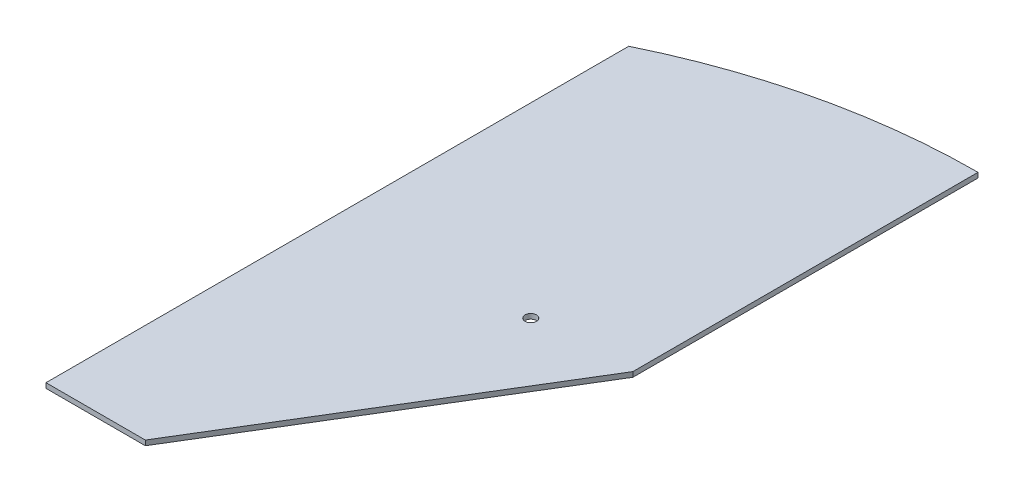
ISO-10303-21;
HEADER;
FILE_DESCRIPTION(('STEP AP214'),'2;1');
FILE_NAME('part.step','',(''),(''),'','','');
FILE_SCHEMA(('AUTOMOTIVE_DESIGN { 1 0 10303 214 1 1 1 1 }'));
ENDSEC;
DATA;
#1=APPLICATION_CONTEXT('core data for automotive mechanical design processes');
#2=APPLICATION_PROTOCOL_DEFINITION('international standard','automotive_design',2000,#1);
#3=PRODUCT_CONTEXT('',#1,'mechanical');
#4=PRODUCT('Part','Part','',(#3));
#5=PRODUCT_RELATED_PRODUCT_CATEGORY('part','',(#4));
#6=PRODUCT_DEFINITION_FORMATION('','',#4);
#7=PRODUCT_DEFINITION_CONTEXT('part definition',#1,'design');
#8=PRODUCT_DEFINITION('design','',#6,#7);
#9=PRODUCT_DEFINITION_SHAPE('','',#8);
#10=(LENGTH_UNIT() NAMED_UNIT(*) SI_UNIT(.MILLI.,.METRE.));
#11=(NAMED_UNIT(*) PLANE_ANGLE_UNIT() SI_UNIT($,.RADIAN.));
#12=(NAMED_UNIT(*) SI_UNIT($,.STERADIAN.) SOLID_ANGLE_UNIT());
#13=UNCERTAINTY_MEASURE_WITH_UNIT(LENGTH_MEASURE(1.E-05),#10,'distance_accuracy_value','');
#14=(GEOMETRIC_REPRESENTATION_CONTEXT(3) GLOBAL_UNCERTAINTY_ASSIGNED_CONTEXT((#13)) GLOBAL_UNIT_ASSIGNED_CONTEXT((#10,
#11,#12)) REPRESENTATION_CONTEXT('',''));
#15=CARTESIAN_POINT('',(0.,0.,0.));
#16=DIRECTION('',(0.,0.,1.));
#17=DIRECTION('',(1.,0.,0.));
#18=AXIS2_PLACEMENT_3D('',#15,#16,#17);
#19=CARTESIAN_POINT('',(-90.1768403474196,1.925,-167.326045177922));
#20=DIRECTION('',(1.,0.,0.));
#21=DIRECTION('',(0.,0.,-1.));
#22=AXIS2_PLACEMENT_3D('',#19,#20,#21);
#23=PLANE('',#22);
#24=DIRECTION('',(0.,0.,1.));
#25=VECTOR('',#24,1.);
#26=CARTESIAN_POINT('',(-90.1768403474196,-1.575,-167.326045177922));
#27=LINE('',#26,#25);
#28=CARTESIAN_POINT('',(-90.1768403474195,-1.575,-167.326045177923));
#29=VERTEX_POINT('',#28);
#30=CARTESIAN_POINT('',(-90.1768403474196,-1.575,243.331412765094));
#31=VERTEX_POINT('',#30);
#32=EDGE_CURVE('E117',#29,#31,#27,.T.);
#33=ORIENTED_EDGE('',*,*,#32,.T.);
#34=DIRECTION('',(0.,-1.,0.));
#35=VECTOR('',#34,1.);
#36=CARTESIAN_POINT('',(-90.1768403474196,1.925,243.331412765094));
#37=LINE('',#36,#35);
#38=CARTESIAN_POINT('',(-90.1768403474196,1.925,243.331412765094));
#39=VERTEX_POINT('',#38);
#40=EDGE_CURVE('E11',#39,#31,#37,.T.);
#41=ORIENTED_EDGE('',*,*,#40,.F.);
#42=DIRECTION('',(0.,0.,1.));
#43=VECTOR('',#42,1.);
#44=CARTESIAN_POINT('',(-90.1768403474196,1.925,-167.326045177922));
#45=LINE('',#44,#43);
#46=CARTESIAN_POINT('',(-90.1768403474195,1.925,-167.326045177923));
#47=VERTEX_POINT('',#46);
#48=EDGE_CURVE('E131',#47,#39,#45,.T.);
#49=ORIENTED_EDGE('',*,*,#48,.F.);
#50=DIRECTION('',(0.,-1.,0.));
#51=VECTOR('',#50,1.);
#52=CARTESIAN_POINT('',(-90.1768403474195,1.925,-167.326045177923));
#53=LINE('',#52,#51);
#54=EDGE_CURVE('E113',#47,#29,#53,.T.);
#55=ORIENTED_EDGE('',*,*,#54,.T.);
#56=EDGE_LOOP('',(#33,#41,#49,#55));
#57=FACE_BOUND('',#56,.T.);
#58=ADVANCED_FACE('F38',(#57),#23,.F.);
#59=CARTESIAN_POINT('',(-20.1768403474217,1.925,243.331412765094));
#60=DIRECTION('',(0.,0.,-1.));
#61=DIRECTION('',(-1.,0.,0.));
#62=AXIS2_PLACEMENT_3D('',#59,#60,#61);
#63=PLANE('',#62);
#64=DIRECTION('',(1.,0.,0.));
#65=VECTOR('',#64,1.);
#66=CARTESIAN_POINT('',(-20.1768403474217,-1.575,243.331412765094));
#67=LINE('',#66,#65);
#68=CARTESIAN_POINT('',(-20.1768403474217,-1.575,243.331412765094));
#69=VERTEX_POINT('',#68);
#70=EDGE_CURVE('E121',#31,#69,#67,.T.);
#71=ORIENTED_EDGE('',*,*,#70,.T.);
#72=DIRECTION('',(0.,-1.,0.));
#73=VECTOR('',#72,1.);
#74=CARTESIAN_POINT('',(-20.1768403474217,1.925,243.331412765094));
#75=LINE('',#74,#73);
#76=CARTESIAN_POINT('',(-20.1768403474217,1.925,243.331412765094));
#77=VERTEX_POINT('',#76);
#78=EDGE_CURVE('E47',#77,#69,#75,.T.);
#79=ORIENTED_EDGE('',*,*,#78,.F.);
#80=DIRECTION('',(1.,0.,0.));
#81=VECTOR('',#80,1.);
#82=CARTESIAN_POINT('',(-20.1768403474217,1.925,243.331412765094));
#83=LINE('',#82,#81);
#84=EDGE_CURVE('E89',#39,#77,#83,.T.);
#85=ORIENTED_EDGE('',*,*,#84,.F.);
#86=ORIENTED_EDGE('',*,*,#40,.T.);
#87=EDGE_LOOP('',(#71,#79,#85,#86));
#88=FACE_BOUND('',#87,.T.);
#89=ADVANCED_FACE('F155',(#88),#63,.F.);
#90=CARTESIAN_POINT('',(-20.1768403474217,1.925,243.331412765094));
#91=DIRECTION('',(-0.854166260162505,0.,-0.52));
#92=DIRECTION('',(-0.52,0.,0.854166260162505));
#93=AXIS2_PLACEMENT_3D('',#90,#91,#92);
#94=PLANE('',#93);
#95=DIRECTION('',(0.52,0.,-0.854166260162505));
#96=VECTOR('',#95,1.);
#97=CARTESIAN_POINT('',(-20.1768403474217,-1.575,243.331412765094));
#98=LINE('',#97,#96);
#99=CARTESIAN_POINT('',(109.823159652578,-1.575,29.7898477244672));
#100=VERTEX_POINT('',#99);
#101=EDGE_CURVE('E105',#69,#100,#98,.T.);
#102=ORIENTED_EDGE('',*,*,#101,.T.);
#103=DIRECTION('',(0.,-1.,0.));
#104=VECTOR('',#103,1.);
#105=CARTESIAN_POINT('',(109.823159652578,1.925,29.7898477244672));
#106=LINE('',#105,#104);
#107=CARTESIAN_POINT('',(109.823159652578,1.925,29.7898477244672));
#108=VERTEX_POINT('',#107);
#109=EDGE_CURVE('E102',#108,#100,#106,.T.);
#110=ORIENTED_EDGE('',*,*,#109,.F.);
#111=DIRECTION('',(0.52,0.,-0.854166260162505));
#112=VECTOR('',#111,1.);
#113=CARTESIAN_POINT('',(-20.1768403474217,1.925,243.331412765094));
#114=LINE('',#113,#112);
#115=EDGE_CURVE('E93',#77,#108,#114,.T.);
#116=ORIENTED_EDGE('',*,*,#115,.F.);
#117=ORIENTED_EDGE('',*,*,#78,.T.);
#118=EDGE_LOOP('',(#102,#110,#116,#117));
#119=FACE_BOUND('',#118,.T.);
#120=ADVANCED_FACE('F103',(#119),#94,.F.);
#121=CARTESIAN_POINT('',(109.823159652578,1.925,29.7898477244672));
#122=DIRECTION('',(-1.,0.,0.));
#123=DIRECTION('',(0.,0.,1.));
#124=AXIS2_PLACEMENT_3D('',#121,#122,#123);
#125=PLANE('',#124);
#126=DIRECTION('',(0.,0.,-1.));
#127=VECTOR('',#126,1.);
#128=CARTESIAN_POINT('',(109.823159652578,-1.575,29.7898477244672));
#129=LINE('',#128,#127);
#130=CARTESIAN_POINT('',(109.823159652578,-1.575,-213.43936975522));
#131=VERTEX_POINT('',#130);
#132=EDGE_CURVE('E75',#100,#131,#129,.T.);
#133=ORIENTED_EDGE('',*,*,#132,.T.);
#134=DIRECTION('',(0.,-1.,0.));
#135=VECTOR('',#134,1.);
#136=CARTESIAN_POINT('',(109.823159652578,1.925,-213.43936975522));
#137=LINE('',#136,#135);
#138=CARTESIAN_POINT('',(109.823159652578,1.925,-213.43936975522));
#139=VERTEX_POINT('',#138);
#140=EDGE_CURVE('E107',#139,#131,#137,.T.);
#141=ORIENTED_EDGE('',*,*,#140,.F.);
#142=DIRECTION('',(0.,0.,-1.));
#143=VECTOR('',#142,1.);
#144=CARTESIAN_POINT('',(109.823159652578,1.925,29.7898477244672));
#145=LINE('',#144,#143);
#146=EDGE_CURVE('E97',#108,#139,#145,.T.);
#147=ORIENTED_EDGE('',*,*,#146,.F.);
#148=ORIENTED_EDGE('',*,*,#109,.T.);
#149=EDGE_LOOP('',(#133,#141,#147,#148));
#150=FACE_BOUND('',#149,.T.);
#151=ADVANCED_FACE('F109',(#150),#125,.F.);
#152=CARTESIAN_POINT('',(109.823159652578,1.925,243.331412765094));
#153=DIRECTION('',(0.,-1.,0.));
#154=DIRECTION('',(0.,0.,-1.));
#155=AXIS2_PLACEMENT_3D('',#152,#153,#154);
#156=CYLINDRICAL_SURFACE('',#155,456.770782520313);
#157=CARTESIAN_POINT('',(109.823159652578,-1.575,243.331412765094));
#158=DIRECTION('',(0.,1.,0.));
#159=DIRECTION('',(0.,0.,1.));
#160=AXIS2_PLACEMENT_3D('',#157,#158,#159);
#161=CIRCLE('',#160,456.770782520313);
#162=EDGE_CURVE('E81',#131,#29,#161,.T.);
#163=ORIENTED_EDGE('',*,*,#162,.T.);
#164=ORIENTED_EDGE('',*,*,#54,.F.);
#165=CARTESIAN_POINT('',(109.823159652578,1.925,243.331412765094));
#166=DIRECTION('',(0.,1.,0.));
#167=DIRECTION('',(0.,0.,1.));
#168=AXIS2_PLACEMENT_3D('',#165,#166,#167);
#169=CIRCLE('',#168,456.770782520313);
#170=EDGE_CURVE('E55',#139,#47,#169,.T.);
#171=ORIENTED_EDGE('',*,*,#170,.F.);
#172=ORIENTED_EDGE('',*,*,#140,.T.);
#173=EDGE_LOOP('',(#163,#164,#171,#172));
#174=FACE_BOUND('',#173,.T.);
#175=ADVANCED_FACE('F142',(#174),#156,.T.);
#176=CARTESIAN_POINT('',(109.823159652578,1.925,243.331412765094));
#177=DIRECTION('',(0.,1.,0.));
#178=DIRECTION('',(0.,0.,1.));
#179=AXIS2_PLACEMENT_3D('',#176,#177,#178);
#180=PLANE('',#179);
#181=CARTESIAN_POINT('',(41.2164685761995,1.925,33.1183188656826));
#182=DIRECTION('',(0.,1.,0.));
#183=DIRECTION('',(0.,0.,1.));
#184=AXIS2_PLACEMENT_3D('',#181,#182,#183);
#185=CIRCLE('',#184,4.00000000000001);
#186=CARTESIAN_POINT('',(41.2164685761995,1.925,37.1183188656826));
#187=VERTEX_POINT('',#186);
#188=EDGE_CURVE('E122',#187,#187,#185,.T.);
#189=ORIENTED_EDGE('',*,*,#188,.F.);
#190=EDGE_LOOP('',(#189));
#191=FACE_BOUND('',#190,.T.);
#192=ORIENTED_EDGE('',*,*,#48,.T.);
#193=ORIENTED_EDGE('',*,*,#84,.T.);
#194=ORIENTED_EDGE('',*,*,#115,.T.);
#195=ORIENTED_EDGE('',*,*,#146,.T.);
#196=ORIENTED_EDGE('',*,*,#170,.T.);
#197=EDGE_LOOP('',(#192,#193,#194,#195,#196));
#198=FACE_BOUND('',#197,.T.);
#199=ADVANCED_FACE('F95',(#191,#198),#180,.T.);
#200=CARTESIAN_POINT('',(109.823159652578,-1.575,243.331412765094));
#201=DIRECTION('',(0.,1.,0.));
#202=DIRECTION('',(0.,0.,1.));
#203=AXIS2_PLACEMENT_3D('',#200,#201,#202);
#204=PLANE('',#203);
#205=CARTESIAN_POINT('',(41.2164685761995,-1.575,33.1183188656826));
#206=DIRECTION('',(0.,1.,0.));
#207=DIRECTION('',(0.,0.,1.));
#208=AXIS2_PLACEMENT_3D('',#205,#206,#207);
#209=CIRCLE('',#208,4.00000000000001);
#210=CARTESIAN_POINT('',(41.2164685761995,-1.575,37.1183188656826));
#211=VERTEX_POINT('',#210);
#212=EDGE_CURVE('E205',#211,#211,#209,.T.);
#213=ORIENTED_EDGE('',*,*,#212,.T.);
#214=EDGE_LOOP('',(#213));
#215=FACE_BOUND('',#214,.T.);
#216=ORIENTED_EDGE('',*,*,#32,.F.);
#217=ORIENTED_EDGE('',*,*,#162,.F.);
#218=ORIENTED_EDGE('',*,*,#132,.F.);
#219=ORIENTED_EDGE('',*,*,#101,.F.);
#220=ORIENTED_EDGE('',*,*,#70,.F.);
#221=EDGE_LOOP('',(#216,#217,#218,#219,#220));
#222=FACE_BOUND('',#221,.T.);
#223=ADVANCED_FACE('F138',(#215,#222),#204,.F.);
#224=CARTESIAN_POINT('',(41.2164685761995,-1.575,33.1183188656826));
#225=DIRECTION('',(0.,1.,0.));
#226=DIRECTION('',(0.,0.,1.));
#227=AXIS2_PLACEMENT_3D('',#224,#225,#226);
#228=CYLINDRICAL_SURFACE('',#227,4.00000000000001);
#229=ORIENTED_EDGE('',*,*,#188,.T.);
#230=EDGE_LOOP('',(#229));
#231=FACE_BOUND('',#230,.T.);
#232=ORIENTED_EDGE('',*,*,#212,.F.);
#233=EDGE_LOOP('',(#232));
#234=FACE_BOUND('',#233,.T.);
#235=ADVANCED_FACE('F184',(#231,#234),#228,.F.);
#236=CLOSED_SHELL('',(#58,#89,#120,#151,#175,#199,#223,#235));
#237=MANIFOLD_SOLID_BREP('B2',#236);
#238=ADVANCED_BREP_SHAPE_REPRESENTATION('',(#18,#237),#14);
#239=SHAPE_DEFINITION_REPRESENTATION(#9,#238);
ENDSEC;
END-ISO-10303-21;
